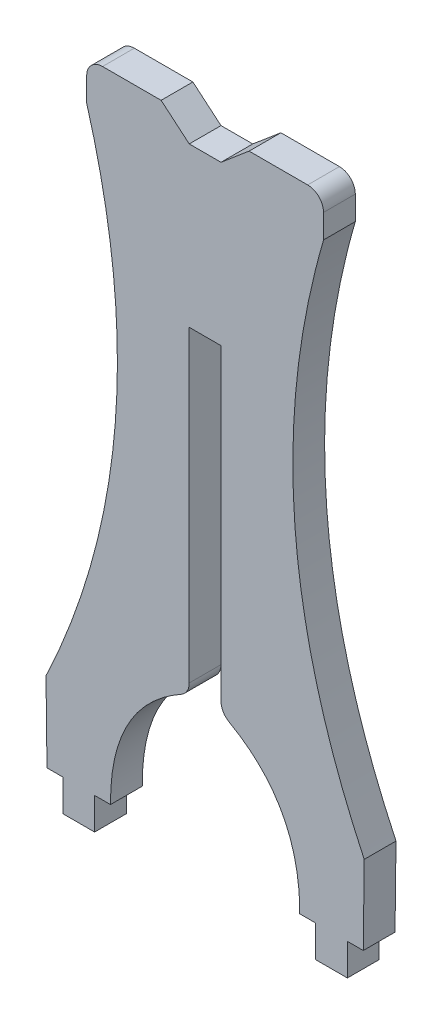
ISO-10303-21;
HEADER;
FILE_DESCRIPTION(('STEP AP214'),'2;1');
FILE_NAME('part.step','',(''),(''),'','','');
FILE_SCHEMA(('AUTOMOTIVE_DESIGN { 1 0 10303 214 1 1 1 1 }'));
ENDSEC;
DATA;
#1=APPLICATION_CONTEXT('core data for automotive mechanical design processes');
#2=APPLICATION_PROTOCOL_DEFINITION('international standard','automotive_design',2000,#1);
#3=PRODUCT_CONTEXT('',#1,'mechanical');
#4=PRODUCT('Part','Part','',(#3));
#5=PRODUCT_RELATED_PRODUCT_CATEGORY('part','',(#4));
#6=PRODUCT_DEFINITION_FORMATION('','',#4);
#7=PRODUCT_DEFINITION_CONTEXT('part definition',#1,'design');
#8=PRODUCT_DEFINITION('design','',#6,#7);
#9=PRODUCT_DEFINITION_SHAPE('','',#8);
#10=(LENGTH_UNIT() NAMED_UNIT(*) SI_UNIT(.MILLI.,.METRE.));
#11=(NAMED_UNIT(*) PLANE_ANGLE_UNIT() SI_UNIT($,.RADIAN.));
#12=(NAMED_UNIT(*) SI_UNIT($,.STERADIAN.) SOLID_ANGLE_UNIT());
#13=UNCERTAINTY_MEASURE_WITH_UNIT(LENGTH_MEASURE(1.E-05),#10,'distance_accuracy_value','');
#14=(GEOMETRIC_REPRESENTATION_CONTEXT(3) GLOBAL_UNCERTAINTY_ASSIGNED_CONTEXT((#13)) GLOBAL_UNIT_ASSIGNED_CONTEXT((#10,
#11,#12)) REPRESENTATION_CONTEXT('',''));
#15=CARTESIAN_POINT('',(0.,0.,0.));
#16=DIRECTION('',(0.,0.,1.));
#17=DIRECTION('',(1.,0.,0.));
#18=AXIS2_PLACEMENT_3D('',#15,#16,#17);
#19=CARTESIAN_POINT('',(27.9830745326083,55.8629681276195,5.08));
#20=DIRECTION('',(1.,0.,0.));
#21=DIRECTION('',(0.,1.,0.));
#22=AXIS2_PLACEMENT_3D('',#19,#20,#21);
#23=PLANE('',#22);
#24=DIRECTION('',(0.,-1.,0.));
#25=VECTOR('',#24,1.);
#26=CARTESIAN_POINT('',(27.9830745326083,55.8629681276195,0.));
#27=LINE('',#26,#25);
#28=CARTESIAN_POINT('',(27.9830745326083,55.8629681276195,0.));
#29=VERTEX_POINT('',#28);
#30=CARTESIAN_POINT('',(27.9830745326084,6.59401353380646,0.));
#31=VERTEX_POINT('',#30);
#32=EDGE_CURVE('E568',#29,#31,#27,.T.);
#33=ORIENTED_EDGE('',*,*,#32,.T.);
#34=DIRECTION('',(0.,0.,-1.));
#35=VECTOR('',#34,1.);
#36=CARTESIAN_POINT('',(27.9830745326084,6.59401353380646,5.08));
#37=LINE('',#36,#35);
#38=CARTESIAN_POINT('',(27.9830745326084,6.59401353380646,5.08));
#39=VERTEX_POINT('',#38);
#40=EDGE_CURVE('E348',#31,#39,#37,.F.);
#41=ORIENTED_EDGE('',*,*,#40,.T.);
#42=DIRECTION('',(0.,-1.,0.));
#43=VECTOR('',#42,1.);
#44=CARTESIAN_POINT('',(27.9830745326083,55.8629681276195,5.08));
#45=LINE('',#44,#43);
#46=CARTESIAN_POINT('',(27.9830745326083,55.8629681276195,5.08));
#47=VERTEX_POINT('',#46);
#48=EDGE_CURVE('E248',#47,#39,#45,.T.);
#49=ORIENTED_EDGE('',*,*,#48,.F.);
#50=DIRECTION('',(0.,0.,-1.));
#51=VECTOR('',#50,1.);
#52=CARTESIAN_POINT('',(27.9830745326083,55.8629681276195,5.08));
#53=LINE('',#52,#51);
#54=EDGE_CURVE('E470',#47,#29,#53,.T.);
#55=ORIENTED_EDGE('',*,*,#54,.T.);
#56=EDGE_LOOP('',(#33,#41,#49,#55));
#57=FACE_BOUND('',#56,.T.);
#58=ADVANCED_FACE('F39',(#57),#23,.F.);
#59=CARTESIAN_POINT('',(27.9830745326084,5.06296812761946,5.08));
#60=CARTESIAN_POINT('',(40.6838190643054,-1.22119794048092,5.08));
#61=CARTESIAN_POINT('',(40.5778042251728,-16.5430066938405,5.08));
#62=B_SPLINE_CURVE_WITH_KNOTS('',2,(#59,#60,#61),.UNSPECIFIED.,.F.,.F.,(3,3),(0.,1.),.UNSPECIFIED.);
#63=DIRECTION('',(0.,0.,-1.));
#64=VECTOR('',#63,1.);
#65=SURFACE_OF_LINEAR_EXTRUSION('',#62,#64);
#66=CARTESIAN_POINT('',(29.2790530108819,4.37951348786349,5.08));
#67=VERTEX_POINT('',#66);
#68=CARTESIAN_POINT('',(40.5778042251728,-16.5430066938405,5.08));
#69=VERTEX_POINT('',#68);
#70=EDGE_CURVE('E235',#67,#69,#62,.T.);
#71=ORIENTED_EDGE('',*,*,#70,.F.);
#72=DIRECTION('',(0.,0.,-1.));
#73=VECTOR('',#72,1.);
#74=CARTESIAN_POINT('',(29.2790530108819,4.37951348786349,5.08));
#75=LINE('',#74,#73);
#76=CARTESIAN_POINT('',(29.2790530108819,4.37951348786349,0.));
#77=VERTEX_POINT('',#76);
#78=EDGE_CURVE('E349',#67,#77,#75,.T.);
#79=ORIENTED_EDGE('',*,*,#78,.T.);
#80=CARTESIAN_POINT('',(27.9830745326084,5.06296812761946,0.));
#81=CARTESIAN_POINT('',(40.6838190643054,-1.22119794048092,0.));
#82=CARTESIAN_POINT('',(40.5778042251728,-16.5430066938405,0.));
#83=B_SPLINE_CURVE_WITH_KNOTS('',2,(#80,#81,#82),.UNSPECIFIED.,.F.,.F.,(3,3),(0.,1.),.UNSPECIFIED.);
#84=CARTESIAN_POINT('',(40.5778042251728,-16.5430066938405,0.));
#85=VERTEX_POINT('',#84);
#86=EDGE_CURVE('E254',#77,#85,#83,.T.);
#87=ORIENTED_EDGE('',*,*,#86,.T.);
#88=DIRECTION('',(0.,0.,-1.));
#89=VECTOR('',#88,1.);
#90=CARTESIAN_POINT('',(40.5778042251728,-16.5430066938405,5.08));
#91=LINE('',#90,#89);
#92=EDGE_CURVE('E251',#69,#85,#91,.T.);
#93=ORIENTED_EDGE('',*,*,#92,.F.);
#94=EDGE_LOOP('',(#71,#79,#87,#93));
#95=FACE_BOUND('',#94,.T.);
#96=ADVANCED_FACE('F252',(#95),#65,.F.);
#97=CARTESIAN_POINT('',(43.1178042251728,-16.5430066938405,5.08));
#98=DIRECTION('',(0.,1.,0.));
#99=DIRECTION('',(0.,0.,1.));
#100=AXIS2_PLACEMENT_3D('',#97,#98,#99);
#101=PLANE('',#100);
#102=DIRECTION('',(1.,0.,0.));
#103=VECTOR('',#102,1.);
#104=CARTESIAN_POINT('',(43.1178042251728,-16.5430066938405,0.));
#105=LINE('',#104,#103);
#106=CARTESIAN_POINT('',(43.1178042251728,-16.5430066938405,0.));
#107=VERTEX_POINT('',#106);
#108=EDGE_CURVE('E561',#85,#107,#105,.T.);
#109=ORIENTED_EDGE('',*,*,#108,.T.);
#110=DIRECTION('',(0.,0.,-1.));
#111=VECTOR('',#110,1.);
#112=CARTESIAN_POINT('',(43.1178042251728,-16.5430066938405,5.08));
#113=LINE('',#112,#111);
#114=CARTESIAN_POINT('',(43.1178042251728,-16.5430066938405,5.08));
#115=VERTEX_POINT('',#114);
#116=EDGE_CURVE('E259',#115,#107,#113,.T.);
#117=ORIENTED_EDGE('',*,*,#116,.F.);
#118=DIRECTION('',(1.,0.,0.));
#119=VECTOR('',#118,1.);
#120=CARTESIAN_POINT('',(43.1178042251728,-16.5430066938405,5.08));
#121=LINE('',#120,#119);
#122=EDGE_CURVE('E240',#69,#115,#121,.T.);
#123=ORIENTED_EDGE('',*,*,#122,.F.);
#124=ORIENTED_EDGE('',*,*,#92,.T.);
#125=EDGE_LOOP('',(#109,#117,#123,#124));
#126=FACE_BOUND('',#125,.T.);
#127=ADVANCED_FACE('F261',(#126),#101,.F.);
#128=CARTESIAN_POINT('',(43.1178042251728,-16.5430066938405,5.08));
#129=DIRECTION('',(1.,0.,0.));
#130=DIRECTION('',(0.,1.,0.));
#131=AXIS2_PLACEMENT_3D('',#128,#129,#130);
#132=PLANE('',#131);
#133=DIRECTION('',(0.,-1.,0.));
#134=VECTOR('',#133,1.);
#135=CARTESIAN_POINT('',(43.1178042251728,-16.5430066938405,0.));
#136=LINE('',#135,#134);
#137=CARTESIAN_POINT('',(43.1178042251728,-21.6230066938405,0.));
#138=VERTEX_POINT('',#137);
#139=EDGE_CURVE('E558',#107,#138,#136,.T.);
#140=ORIENTED_EDGE('',*,*,#139,.T.);
#141=DIRECTION('',(0.,0.,-1.));
#142=VECTOR('',#141,1.);
#143=CARTESIAN_POINT('',(43.1178042251728,-21.6230066938405,5.08));
#144=LINE('',#143,#142);
#145=CARTESIAN_POINT('',(43.1178042251728,-21.6230066938405,5.08));
#146=VERTEX_POINT('',#145);
#147=EDGE_CURVE('E394',#146,#138,#144,.T.);
#148=ORIENTED_EDGE('',*,*,#147,.F.);
#149=DIRECTION('',(0.,-1.,0.));
#150=VECTOR('',#149,1.);
#151=CARTESIAN_POINT('',(43.1178042251728,-16.5430066938405,5.08));
#152=LINE('',#151,#150);
#153=EDGE_CURVE('E265',#115,#146,#152,.T.);
#154=ORIENTED_EDGE('',*,*,#153,.F.);
#155=ORIENTED_EDGE('',*,*,#116,.T.);
#156=EDGE_LOOP('',(#140,#148,#154,#155));
#157=FACE_BOUND('',#156,.T.);
#158=ADVANCED_FACE('F320',(#157),#132,.F.);
#159=CARTESIAN_POINT('',(48.1978042251728,-21.6230066938405,5.08));
#160=DIRECTION('',(0.,1.,0.));
#161=DIRECTION('',(0.,0.,1.));
#162=AXIS2_PLACEMENT_3D('',#159,#160,#161);
#163=PLANE('',#162);
#164=DIRECTION('',(1.,0.,0.));
#165=VECTOR('',#164,1.);
#166=CARTESIAN_POINT('',(48.1978042251728,-21.6230066938405,0.));
#167=LINE('',#166,#165);
#168=CARTESIAN_POINT('',(48.1978042251728,-21.6230066938405,0.));
#169=VERTEX_POINT('',#168);
#170=EDGE_CURVE('E555',#138,#169,#167,.T.);
#171=ORIENTED_EDGE('',*,*,#170,.T.);
#172=DIRECTION('',(0.,0.,-1.));
#173=VECTOR('',#172,1.);
#174=CARTESIAN_POINT('',(48.1978042251728,-21.6230066938405,5.08));
#175=LINE('',#174,#173);
#176=CARTESIAN_POINT('',(48.1978042251728,-21.6230066938405,5.08));
#177=VERTEX_POINT('',#176);
#178=EDGE_CURVE('E398',#177,#169,#175,.T.);
#179=ORIENTED_EDGE('',*,*,#178,.F.);
#180=DIRECTION('',(1.,0.,0.));
#181=VECTOR('',#180,1.);
#182=CARTESIAN_POINT('',(48.1978042251728,-21.6230066938405,5.08));
#183=LINE('',#182,#181);
#184=EDGE_CURVE('E268',#146,#177,#183,.T.);
#185=ORIENTED_EDGE('',*,*,#184,.F.);
#186=ORIENTED_EDGE('',*,*,#147,.T.);
#187=EDGE_LOOP('',(#171,#179,#185,#186));
#188=FACE_BOUND('',#187,.T.);
#189=ADVANCED_FACE('F316',(#188),#163,.F.);
#190=CARTESIAN_POINT('',(48.1978042251728,-16.5430066938405,5.08));
#191=DIRECTION('',(-1.,0.,0.));
#192=DIRECTION('',(0.,-1.,0.));
#193=AXIS2_PLACEMENT_3D('',#190,#191,#192);
#194=PLANE('',#193);
#195=DIRECTION('',(0.,1.,0.));
#196=VECTOR('',#195,1.);
#197=CARTESIAN_POINT('',(48.1978042251728,-16.5430066938405,0.));
#198=LINE('',#197,#196);
#199=CARTESIAN_POINT('',(48.1978042251728,-16.5430066938405,0.));
#200=VERTEX_POINT('',#199);
#201=EDGE_CURVE('E552',#169,#200,#198,.T.);
#202=ORIENTED_EDGE('',*,*,#201,.T.);
#203=DIRECTION('',(0.,0.,-1.));
#204=VECTOR('',#203,1.);
#205=CARTESIAN_POINT('',(48.1978042251728,-16.5430066938405,5.08));
#206=LINE('',#205,#204);
#207=CARTESIAN_POINT('',(48.1978042251728,-16.5430066938405,5.08));
#208=VERTEX_POINT('',#207);
#209=EDGE_CURVE('E402',#208,#200,#206,.T.);
#210=ORIENTED_EDGE('',*,*,#209,.F.);
#211=DIRECTION('',(0.,1.,0.));
#212=VECTOR('',#211,1.);
#213=CARTESIAN_POINT('',(48.1978042251728,-16.5430066938405,5.08));
#214=LINE('',#213,#212);
#215=EDGE_CURVE('E277',#177,#208,#214,.T.);
#216=ORIENTED_EDGE('',*,*,#215,.F.);
#217=ORIENTED_EDGE('',*,*,#178,.T.);
#218=EDGE_LOOP('',(#202,#210,#216,#217));
#219=FACE_BOUND('',#218,.T.);
#220=ADVANCED_FACE('F312',(#219),#194,.F.);
#221=CARTESIAN_POINT('',(50.7378042251728,-16.5430066938405,5.08));
#222=DIRECTION('',(0.,1.,0.));
#223=DIRECTION('',(0.,0.,1.));
#224=AXIS2_PLACEMENT_3D('',#221,#222,#223);
#225=PLANE('',#224);
#226=DIRECTION('',(1.,0.,0.));
#227=VECTOR('',#226,1.);
#228=CARTESIAN_POINT('',(50.7378042251728,-16.5430066938405,0.));
#229=LINE('',#228,#227);
#230=CARTESIAN_POINT('',(50.7378042251728,-16.5430066938405,0.));
#231=VERTEX_POINT('',#230);
#232=EDGE_CURVE('E549',#200,#231,#229,.T.);
#233=ORIENTED_EDGE('',*,*,#232,.T.);
#234=DIRECTION('',(0.,0.,-1.));
#235=VECTOR('',#234,1.);
#236=CARTESIAN_POINT('',(50.7378042251728,-16.5430066938405,5.08));
#237=LINE('',#236,#235);
#238=CARTESIAN_POINT('',(50.7378042251728,-16.5430066938405,5.08));
#239=VERTEX_POINT('',#238);
#240=EDGE_CURVE('E406',#239,#231,#237,.T.);
#241=ORIENTED_EDGE('',*,*,#240,.F.);
#242=DIRECTION('',(1.,0.,0.));
#243=VECTOR('',#242,1.);
#244=CARTESIAN_POINT('',(50.7378042251728,-16.5430066938405,5.08));
#245=LINE('',#244,#243);
#246=EDGE_CURVE('E280',#208,#239,#245,.T.);
#247=ORIENTED_EDGE('',*,*,#246,.F.);
#248=ORIENTED_EDGE('',*,*,#209,.T.);
#249=EDGE_LOOP('',(#233,#241,#247,#248));
#250=FACE_BOUND('',#249,.T.);
#251=ADVANCED_FACE('F308',(#250),#225,.F.);
#252=CARTESIAN_POINT('',(50.7378042251728,-16.5430066938405,5.08));
#253=DIRECTION('',(-0.999926254512772,0.0121443623158392,0.));
#254=DIRECTION('',(-0.0121443623158392,-0.999926254512772,0.));
#255=AXIS2_PLACEMENT_3D('',#252,#253,#254);
#256=PLANE('',#255);
#257=DIRECTION('',(0.0121443623158392,0.999926254512772,0.));
#258=VECTOR('',#257,1.);
#259=CARTESIAN_POINT('',(50.7378042251728,-16.5430066938405,0.));
#260=LINE('',#259,#258);
#261=CARTESIAN_POINT('',(50.892037626584,-3.84394326152831,0.));
#262=VERTEX_POINT('',#261);
#263=EDGE_CURVE('E543',#231,#262,#260,.T.);
#264=ORIENTED_EDGE('',*,*,#263,.T.);
#265=DIRECTION('',(0.,0.,-1.));
#266=VECTOR('',#265,1.);
#267=CARTESIAN_POINT('',(50.892037626584,-3.84394326152831,5.08));
#268=LINE('',#267,#266);
#269=CARTESIAN_POINT('',(50.892037626584,-3.84394326152831,5.08));
#270=VERTEX_POINT('',#269);
#271=EDGE_CURVE('E410',#270,#262,#268,.T.);
#272=ORIENTED_EDGE('',*,*,#271,.F.);
#273=DIRECTION('',(0.0121443623158392,0.999926254512772,0.));
#274=VECTOR('',#273,1.);
#275=CARTESIAN_POINT('',(50.7378042251728,-16.5430066938405,5.08));
#276=LINE('',#275,#274);
#277=EDGE_CURVE('E283',#239,#270,#276,.T.);
#278=ORIENTED_EDGE('',*,*,#277,.F.);
#279=ORIENTED_EDGE('',*,*,#240,.T.);
#280=EDGE_LOOP('',(#264,#272,#278,#279));
#281=FACE_BOUND('',#280,.T.);
#282=ADVANCED_FACE('F303',(#281),#256,.F.);
#283=CARTESIAN_POINT('',(50.892037626584,-3.84394326152831,5.08));
#284=CARTESIAN_POINT('',(31.9843408580239,35.9899355292535,5.08));
#285=CARTESIAN_POINT('',(44.3859686406762,78.7069933061595,5.08));
#286=B_SPLINE_CURVE_WITH_KNOTS('',2,(#283,#284,#285),.UNSPECIFIED.,.F.,.F.,(3,3),(0.,1.),.UNSPECIFIED.);
#287=DIRECTION('',(0.,0.,-1.));
#288=VECTOR('',#287,1.);
#289=SURFACE_OF_LINEAR_EXTRUSION('',#286,#288);
#290=CARTESIAN_POINT('',(50.892037626584,-3.84394326152831,0.));
#291=CARTESIAN_POINT('',(31.9843408580239,35.9899355292535,0.));
#292=CARTESIAN_POINT('',(44.3859686406762,78.7069933061595,0.));
#293=B_SPLINE_CURVE_WITH_KNOTS('',2,(#290,#291,#292),.UNSPECIFIED.,.F.,.F.,(3,3),(0.,1.),.UNSPECIFIED.);
#294=CARTESIAN_POINT('',(44.3859686406762,78.7069933061595,0.));
#295=VERTEX_POINT('',#294);
#296=EDGE_CURVE('E538',#262,#295,#293,.T.);
#297=ORIENTED_EDGE('',*,*,#296,.T.);
#298=DIRECTION('',(0.,0.,-1.));
#299=VECTOR('',#298,1.);
#300=CARTESIAN_POINT('',(44.3859686406762,78.7069933061595,5.08));
#301=LINE('',#300,#299);
#302=CARTESIAN_POINT('',(44.3859686406762,78.7069933061595,5.08));
#303=VERTEX_POINT('',#302);
#304=EDGE_CURVE('E414',#303,#295,#301,.T.);
#305=ORIENTED_EDGE('',*,*,#304,.F.);
#306=EDGE_CURVE('E286',#270,#303,#286,.T.);
#307=ORIENTED_EDGE('',*,*,#306,.F.);
#308=ORIENTED_EDGE('',*,*,#271,.T.);
#309=EDGE_LOOP('',(#297,#305,#307,#308));
#310=FACE_BOUND('',#309,.T.);
#311=ADVANCED_FACE('F298',(#310),#289,.F.);
#312=CARTESIAN_POINT('',(44.3859686406762,85.0569933061595,5.08));
#313=DIRECTION('',(-1.,0.,0.));
#314=DIRECTION('',(0.,0.,1.));
#315=AXIS2_PLACEMENT_3D('',#312,#313,#314);
#316=PLANE('',#315);
#317=DIRECTION('',(0.,1.,0.));
#318=VECTOR('',#317,1.);
#319=CARTESIAN_POINT('',(44.3859686406762,85.0569933061595,0.));
#320=LINE('',#319,#318);
#321=CARTESIAN_POINT('',(44.3859686406762,82.5169933061595,0.));
#322=VERTEX_POINT('',#321);
#323=EDGE_CURVE('E534',#295,#322,#320,.T.);
#324=ORIENTED_EDGE('',*,*,#323,.T.);
#325=DIRECTION('',(0.,0.,-1.));
#326=VECTOR('',#325,1.);
#327=CARTESIAN_POINT('',(44.3859686406762,82.5169933061595,5.08));
#328=LINE('',#327,#326);
#329=CARTESIAN_POINT('',(44.3859686406762,82.5169933061595,5.08));
#330=VERTEX_POINT('',#329);
#331=EDGE_CURVE('E367',#322,#330,#328,.F.);
#332=ORIENTED_EDGE('',*,*,#331,.T.);
#333=DIRECTION('',(0.,1.,0.));
#334=VECTOR('',#333,1.);
#335=CARTESIAN_POINT('',(44.3859686406762,85.0569933061595,5.08));
#336=LINE('',#335,#334);
#337=EDGE_CURVE('E292',#303,#330,#336,.T.);
#338=ORIENTED_EDGE('',*,*,#337,.F.);
#339=ORIENTED_EDGE('',*,*,#304,.T.);
#340=EDGE_LOOP('',(#324,#332,#338,#339));
#341=FACE_BOUND('',#340,.T.);
#342=ADVANCED_FACE('F302',(#341),#316,.F.);
#343=CARTESIAN_POINT('',(44.3859686406762,85.0569933061595,5.08));
#344=DIRECTION('',(0.,-1.,0.));
#345=DIRECTION('',(0.,0.,-1.));
#346=AXIS2_PLACEMENT_3D('',#343,#344,#345);
#347=PLANE('',#346);
#348=DIRECTION('',(-1.,0.,0.));
#349=VECTOR('',#348,1.);
#350=CARTESIAN_POINT('',(44.3859686406762,85.0569933061595,5.08));
#351=LINE('',#350,#349);
#352=CARTESIAN_POINT('',(41.8459686406762,85.0569933061595,5.08));
#353=VERTEX_POINT('',#352);
#354=CARTESIAN_POINT('',(32.4797186406762,85.0569933061595,5.08));
#355=VERTEX_POINT('',#354);
#356=EDGE_CURVE('E911',#353,#355,#351,.T.);
#357=ORIENTED_EDGE('',*,*,#356,.F.);
#358=DIRECTION('',(0.,0.,-1.));
#359=VECTOR('',#358,1.);
#360=CARTESIAN_POINT('',(41.8459686406762,85.0569933061595,5.08));
#361=LINE('',#360,#359);
#362=CARTESIAN_POINT('',(41.8459686406762,85.0569933061595,0.));
#363=VERTEX_POINT('',#362);
#364=EDGE_CURVE('E370',#353,#363,#361,.T.);
#365=ORIENTED_EDGE('',*,*,#364,.T.);
#366=DIRECTION('',(-1.,0.,0.));
#367=VECTOR('',#366,1.);
#368=CARTESIAN_POINT('',(44.3859686406762,85.0569933061595,0.));
#369=LINE('',#368,#367);
#370=CARTESIAN_POINT('',(32.4797186406762,85.0569933061595,0.));
#371=VERTEX_POINT('',#370);
#372=EDGE_CURVE('E531',#363,#371,#369,.T.);
#373=ORIENTED_EDGE('',*,*,#372,.T.);
#374=DIRECTION('',(0.,0.,-1.));
#375=VECTOR('',#374,1.);
#376=CARTESIAN_POINT('',(32.4797186406762,85.0569933061595,5.08));
#377=LINE('',#376,#375);
#378=EDGE_CURVE('E418',#355,#371,#377,.T.);
#379=ORIENTED_EDGE('',*,*,#378,.F.);
#380=EDGE_LOOP('',(#357,#365,#373,#379));
#381=FACE_BOUND('',#380,.T.);
#382=ADVANCED_FACE('F746',(#381),#347,.F.);
#383=CARTESIAN_POINT('',(27.9830745326083,81.2629681276195,5.08));
#384=DIRECTION('',(0.644869123495258,-0.764293015513329,0.));
#385=DIRECTION('',(0.764293015513329,0.644869123495258,0.));
#386=AXIS2_PLACEMENT_3D('',#383,#384,#385);
#387=PLANE('',#386);
#388=DIRECTION('',(-0.764293015513329,-0.644869123495258,0.));
#389=VECTOR('',#388,1.);
#390=CARTESIAN_POINT('',(27.9830745326083,81.2629681276195,0.));
#391=LINE('',#390,#389);
#392=CARTESIAN_POINT('',(27.9830745326083,81.2629681276195,0.));
#393=VERTEX_POINT('',#392);
#394=EDGE_CURVE('E528',#371,#393,#391,.T.);
#395=ORIENTED_EDGE('',*,*,#394,.T.);
#396=DIRECTION('',(0.,0.,-1.));
#397=VECTOR('',#396,1.);
#398=CARTESIAN_POINT('',(27.9830745326083,81.2629681276195,5.08));
#399=LINE('',#398,#397);
#400=CARTESIAN_POINT('',(27.9830745326083,81.2629681276195,5.08));
#401=VERTEX_POINT('',#400);
#402=EDGE_CURVE('E422',#401,#393,#399,.T.);
#403=ORIENTED_EDGE('',*,*,#402,.F.);
#404=DIRECTION('',(-0.764293015513329,-0.644869123495258,0.));
#405=VECTOR('',#404,1.);
#406=CARTESIAN_POINT('',(27.9830745326083,81.2629681276195,5.08));
#407=LINE('',#406,#405);
#408=EDGE_CURVE('E909',#355,#401,#407,.T.);
#409=ORIENTED_EDGE('',*,*,#408,.F.);
#410=ORIENTED_EDGE('',*,*,#378,.T.);
#411=EDGE_LOOP('',(#395,#403,#409,#410));
#412=FACE_BOUND('',#411,.T.);
#413=ADVANCED_FACE('F756',(#412),#387,.F.);
#414=CARTESIAN_POINT('',(22.9030745326083,81.2629681276195,5.08));
#415=DIRECTION('',(0.,-1.,0.));
#416=DIRECTION('',(0.,0.,-1.));
#417=AXIS2_PLACEMENT_3D('',#414,#415,#416);
#418=PLANE('',#417);
#419=DIRECTION('',(-1.,0.,0.));
#420=VECTOR('',#419,1.);
#421=CARTESIAN_POINT('',(22.9030745326083,81.2629681276195,0.));
#422=LINE('',#421,#420);
#423=CARTESIAN_POINT('',(22.9030745326083,81.2629681276195,0.));
#424=VERTEX_POINT('',#423);
#425=EDGE_CURVE('E525',#393,#424,#422,.T.);
#426=ORIENTED_EDGE('',*,*,#425,.T.);
#427=DIRECTION('',(0.,0.,-1.));
#428=VECTOR('',#427,1.);
#429=CARTESIAN_POINT('',(22.9030745326083,81.2629681276195,5.08));
#430=LINE('',#429,#428);
#431=CARTESIAN_POINT('',(22.9030745326083,81.2629681276195,5.08));
#432=VERTEX_POINT('',#431);
#433=EDGE_CURVE('E426',#432,#424,#430,.T.);
#434=ORIENTED_EDGE('',*,*,#433,.F.);
#435=DIRECTION('',(-1.,0.,0.));
#436=VECTOR('',#435,1.);
#437=CARTESIAN_POINT('',(22.9030745326083,81.2629681276195,5.08));
#438=LINE('',#437,#436);
#439=EDGE_CURVE('E891',#401,#432,#438,.T.);
#440=ORIENTED_EDGE('',*,*,#439,.F.);
#441=ORIENTED_EDGE('',*,*,#402,.T.);
#442=EDGE_LOOP('',(#426,#434,#440,#441));
#443=FACE_BOUND('',#442,.T.);
#444=ADVANCED_FACE('F822',(#443),#418,.F.);
#445=CARTESIAN_POINT('',(22.9030745326083,81.2629681276195,5.08));
#446=DIRECTION('',(-0.644869123495257,-0.76429301551333,0.));
#447=DIRECTION('',(0.76429301551333,-0.644869123495257,0.));
#448=AXIS2_PLACEMENT_3D('',#445,#446,#447);
#449=PLANE('',#448);
#450=DIRECTION('',(-0.76429301551333,0.644869123495257,0.));
#451=VECTOR('',#450,1.);
#452=CARTESIAN_POINT('',(22.9030745326083,81.2629681276195,0.));
#453=LINE('',#452,#451);
#454=CARTESIAN_POINT('',(18.4064304245404,85.0569933061595,0.));
#455=VERTEX_POINT('',#454);
#456=EDGE_CURVE('E522',#424,#455,#453,.T.);
#457=ORIENTED_EDGE('',*,*,#456,.T.);
#458=DIRECTION('',(0.,0.,-1.));
#459=VECTOR('',#458,1.);
#460=CARTESIAN_POINT('',(18.4064304245404,85.0569933061595,5.08));
#461=LINE('',#460,#459);
#462=CARTESIAN_POINT('',(18.4064304245404,85.0569933061595,5.08));
#463=VERTEX_POINT('',#462);
#464=EDGE_CURVE('E430',#463,#455,#461,.T.);
#465=ORIENTED_EDGE('',*,*,#464,.F.);
#466=DIRECTION('',(-0.76429301551333,0.644869123495257,0.));
#467=VECTOR('',#466,1.);
#468=CARTESIAN_POINT('',(22.9030745326083,81.2629681276195,5.08));
#469=LINE('',#468,#467);
#470=EDGE_CURVE('E902',#432,#463,#469,.T.);
#471=ORIENTED_EDGE('',*,*,#470,.F.);
#472=ORIENTED_EDGE('',*,*,#433,.T.);
#473=EDGE_LOOP('',(#457,#465,#471,#472));
#474=FACE_BOUND('',#473,.T.);
#475=ADVANCED_FACE('F767',(#474),#449,.F.);
#476=CARTESIAN_POINT('',(6.50018042454045,85.0569933061595,5.08));
#477=DIRECTION('',(0.,-1.,0.));
#478=DIRECTION('',(0.,0.,-1.));
#479=AXIS2_PLACEMENT_3D('',#476,#477,#478);
#480=PLANE('',#479);
#481=DIRECTION('',(-1.,0.,0.));
#482=VECTOR('',#481,1.);
#483=CARTESIAN_POINT('',(6.50018042454045,85.0569933061595,0.));
#484=LINE('',#483,#482);
#485=CARTESIAN_POINT('',(9.04018042454045,85.0569933061595,0.));
#486=VERTEX_POINT('',#485);
#487=EDGE_CURVE('E518',#455,#486,#484,.T.);
#488=ORIENTED_EDGE('',*,*,#487,.T.);
#489=DIRECTION('',(0.,0.,-1.));
#490=VECTOR('',#489,1.);
#491=CARTESIAN_POINT('',(9.04018042454045,85.0569933061595,5.08));
#492=LINE('',#491,#490);
#493=CARTESIAN_POINT('',(9.04018042454045,85.0569933061595,5.08));
#494=VERTEX_POINT('',#493);
#495=EDGE_CURVE('E380',#486,#494,#492,.F.);
#496=ORIENTED_EDGE('',*,*,#495,.T.);
#497=DIRECTION('',(-1.,0.,0.));
#498=VECTOR('',#497,1.);
#499=CARTESIAN_POINT('',(6.50018042454045,85.0569933061595,5.08));
#500=LINE('',#499,#498);
#501=EDGE_CURVE('E899',#463,#494,#500,.T.);
#502=ORIENTED_EDGE('',*,*,#501,.F.);
#503=ORIENTED_EDGE('',*,*,#464,.T.);
#504=EDGE_LOOP('',(#488,#496,#502,#503));
#505=FACE_BOUND('',#504,.T.);
#506=ADVANCED_FACE('F763',(#505),#480,.F.);
#507=CARTESIAN_POINT('',(6.50018042454045,85.0569933061595,5.08));
#508=DIRECTION('',(1.,0.,0.));
#509=DIRECTION('',(0.,1.,0.));
#510=AXIS2_PLACEMENT_3D('',#507,#508,#509);
#511=PLANE('',#510);
#512=DIRECTION('',(0.,-1.,0.));
#513=VECTOR('',#512,1.);
#514=CARTESIAN_POINT('',(6.50018042454045,85.0569933061595,5.08));
#515=LINE('',#514,#513);
#516=CARTESIAN_POINT('',(6.50018042454045,82.5169933061595,5.08));
#517=VERTEX_POINT('',#516);
#518=CARTESIAN_POINT('',(6.50018042454045,78.7069933061595,5.08));
#519=VERTEX_POINT('',#518);
#520=EDGE_CURVE('E637',#517,#519,#515,.T.);
#521=ORIENTED_EDGE('',*,*,#520,.F.);
#522=DIRECTION('',(0.,0.,-1.));
#523=VECTOR('',#522,1.);
#524=CARTESIAN_POINT('',(6.50018042454045,82.5169933061595,5.08));
#525=LINE('',#524,#523);
#526=CARTESIAN_POINT('',(6.50018042454045,82.5169933061595,0.));
#527=VERTEX_POINT('',#526);
#528=EDGE_CURVE('E258',#517,#527,#525,.T.);
#529=ORIENTED_EDGE('',*,*,#528,.T.);
#530=DIRECTION('',(0.,-1.,0.));
#531=VECTOR('',#530,1.);
#532=CARTESIAN_POINT('',(6.50018042454045,85.0569933061595,0.));
#533=LINE('',#532,#531);
#534=CARTESIAN_POINT('',(6.50018042454045,78.7069933061595,0.));
#535=VERTEX_POINT('',#534);
#536=EDGE_CURVE('E512',#527,#535,#533,.T.);
#537=ORIENTED_EDGE('',*,*,#536,.T.);
#538=DIRECTION('',(0.,0.,-1.));
#539=VECTOR('',#538,1.);
#540=CARTESIAN_POINT('',(6.50018042454045,78.7069933061595,5.08));
#541=LINE('',#540,#539);
#542=EDGE_CURVE('E434',#519,#535,#541,.T.);
#543=ORIENTED_EDGE('',*,*,#542,.F.);
#544=EDGE_LOOP('',(#521,#529,#537,#543));
#545=FACE_BOUND('',#544,.T.);
#546=ADVANCED_FACE('F626',(#545),#511,.F.);
#547=CARTESIAN_POINT('',(6.50018042454045,78.7069933061595,5.08));
#548=CARTESIAN_POINT('',(18.9018082071928,35.9899355292535,5.08));
#549=CARTESIAN_POINT('',(-0.00588856136727721,-3.84394326152831,5.08));
#550=B_SPLINE_CURVE_WITH_KNOTS('',2,(#547,#548,#549),.UNSPECIFIED.,.F.,.F.,(3,3),(0.,1.),.UNSPECIFIED.);
#551=DIRECTION('',(0.,0.,-1.));
#552=VECTOR('',#551,1.);
#553=SURFACE_OF_LINEAR_EXTRUSION('',#550,#552);
#554=CARTESIAN_POINT('',(6.50018042454045,78.7069933061595,0.));
#555=CARTESIAN_POINT('',(18.9018082071928,35.9899355292535,0.));
#556=CARTESIAN_POINT('',(-0.00588856136727721,-3.84394326152831,0.));
#557=B_SPLINE_CURVE_WITH_KNOTS('',2,(#554,#555,#556),.UNSPECIFIED.,.F.,.F.,(3,3),(0.,1.),.UNSPECIFIED.);
#558=CARTESIAN_POINT('',(-0.00588856136727721,-3.84394326152831,0.));
#559=VERTEX_POINT('',#558);
#560=EDGE_CURVE('E507',#535,#559,#557,.T.);
#561=ORIENTED_EDGE('',*,*,#560,.T.);
#562=DIRECTION('',(0.,0.,-1.));
#563=VECTOR('',#562,1.);
#564=CARTESIAN_POINT('',(-0.00588856136727721,-3.84394326152831,5.08));
#565=LINE('',#564,#563);
#566=CARTESIAN_POINT('',(-0.00588856136727721,-3.84394326152831,5.08));
#567=VERTEX_POINT('',#566);
#568=EDGE_CURVE('E438',#567,#559,#565,.T.);
#569=ORIENTED_EDGE('',*,*,#568,.F.);
#570=EDGE_CURVE('E629',#519,#567,#550,.T.);
#571=ORIENTED_EDGE('',*,*,#570,.F.);
#572=ORIENTED_EDGE('',*,*,#542,.T.);
#573=EDGE_LOOP('',(#561,#569,#571,#572));
#574=FACE_BOUND('',#573,.T.);
#575=ADVANCED_FACE('F621',(#574),#553,.F.);
#576=CARTESIAN_POINT('',(0.148344840043882,-16.5430066938405,5.08));
#577=DIRECTION('',(0.999926254512772,0.0121443623158393,0.));
#578=DIRECTION('',(-0.0121443623158393,0.999926254512772,0.));
#579=AXIS2_PLACEMENT_3D('',#576,#577,#578);
#580=PLANE('',#579);
#581=DIRECTION('',(0.0121443623158393,-0.999926254512772,0.));
#582=VECTOR('',#581,1.);
#583=CARTESIAN_POINT('',(0.148344840043882,-16.5430066938405,0.));
#584=LINE('',#583,#582);
#585=CARTESIAN_POINT('',(0.148344840043882,-16.5430066938405,0.));
#586=VERTEX_POINT('',#585);
#587=EDGE_CURVE('E504',#559,#586,#584,.T.);
#588=ORIENTED_EDGE('',*,*,#587,.T.);
#589=DIRECTION('',(0.,0.,-1.));
#590=VECTOR('',#589,1.);
#591=CARTESIAN_POINT('',(0.148344840043882,-16.5430066938405,5.08));
#592=LINE('',#591,#590);
#593=CARTESIAN_POINT('',(0.148344840043882,-16.5430066938405,5.08));
#594=VERTEX_POINT('',#593);
#595=EDGE_CURVE('E442',#594,#586,#592,.T.);
#596=ORIENTED_EDGE('',*,*,#595,.F.);
#597=DIRECTION('',(0.0121443623158393,-0.999926254512772,0.));
#598=VECTOR('',#597,1.);
#599=CARTESIAN_POINT('',(0.148344840043882,-16.5430066938405,5.08));
#600=LINE('',#599,#598);
#601=EDGE_CURVE('E636',#567,#594,#600,.T.);
#602=ORIENTED_EDGE('',*,*,#601,.F.);
#603=ORIENTED_EDGE('',*,*,#568,.T.);
#604=EDGE_LOOP('',(#588,#596,#602,#603));
#605=FACE_BOUND('',#604,.T.);
#606=ADVANCED_FACE('F617',(#605),#580,.F.);
#607=CARTESIAN_POINT('',(0.148344840043882,-16.5430066938405,5.08));
#608=DIRECTION('',(0.,1.,0.));
#609=DIRECTION('',(0.,0.,1.));
#610=AXIS2_PLACEMENT_3D('',#607,#608,#609);
#611=PLANE('',#610);
#612=DIRECTION('',(1.,0.,0.));
#613=VECTOR('',#612,1.);
#614=CARTESIAN_POINT('',(0.148344840043882,-16.5430066938405,0.));
#615=LINE('',#614,#613);
#616=CARTESIAN_POINT('',(2.68834484004388,-16.5430066938405,0.));
#617=VERTEX_POINT('',#616);
#618=EDGE_CURVE('E501',#586,#617,#615,.T.);
#619=ORIENTED_EDGE('',*,*,#618,.T.);
#620=DIRECTION('',(0.,0.,-1.));
#621=VECTOR('',#620,1.);
#622=CARTESIAN_POINT('',(2.68834484004388,-16.5430066938405,5.08));
#623=LINE('',#622,#621);
#624=CARTESIAN_POINT('',(2.68834484004388,-16.5430066938405,5.08));
#625=VERTEX_POINT('',#624);
#626=EDGE_CURVE('E446',#625,#617,#623,.T.);
#627=ORIENTED_EDGE('',*,*,#626,.F.);
#628=DIRECTION('',(1.,0.,0.));
#629=VECTOR('',#628,1.);
#630=CARTESIAN_POINT('',(0.148344840043882,-16.5430066938405,5.08));
#631=LINE('',#630,#629);
#632=EDGE_CURVE('E644',#594,#625,#631,.T.);
#633=ORIENTED_EDGE('',*,*,#632,.F.);
#634=ORIENTED_EDGE('',*,*,#595,.T.);
#635=EDGE_LOOP('',(#619,#627,#633,#634));
#636=FACE_BOUND('',#635,.T.);
#637=ADVANCED_FACE('F613',(#636),#611,.F.);
#638=CARTESIAN_POINT('',(2.68834484004388,-16.5430066938405,5.08));
#639=DIRECTION('',(1.,0.,0.));
#640=DIRECTION('',(0.,1.,0.));
#641=AXIS2_PLACEMENT_3D('',#638,#639,#640);
#642=PLANE('',#641);
#643=DIRECTION('',(0.,-1.,0.));
#644=VECTOR('',#643,1.);
#645=CARTESIAN_POINT('',(2.68834484004388,-16.5430066938405,0.));
#646=LINE('',#645,#644);
#647=CARTESIAN_POINT('',(2.68834484004388,-21.6230066938405,0.));
#648=VERTEX_POINT('',#647);
#649=EDGE_CURVE('E498',#617,#648,#646,.T.);
#650=ORIENTED_EDGE('',*,*,#649,.T.);
#651=DIRECTION('',(0.,0.,-1.));
#652=VECTOR('',#651,1.);
#653=CARTESIAN_POINT('',(2.68834484004388,-21.6230066938405,5.08));
#654=LINE('',#653,#652);
#655=CARTESIAN_POINT('',(2.68834484004388,-21.6230066938405,5.08));
#656=VERTEX_POINT('',#655);
#657=EDGE_CURVE('E450',#656,#648,#654,.T.);
#658=ORIENTED_EDGE('',*,*,#657,.F.);
#659=DIRECTION('',(0.,-1.,0.));
#660=VECTOR('',#659,1.);
#661=CARTESIAN_POINT('',(2.68834484004388,-16.5430066938405,5.08));
#662=LINE('',#661,#660);
#663=EDGE_CURVE('E647',#625,#656,#662,.T.);
#664=ORIENTED_EDGE('',*,*,#663,.F.);
#665=ORIENTED_EDGE('',*,*,#626,.T.);
#666=EDGE_LOOP('',(#650,#658,#664,#665));
#667=FACE_BOUND('',#666,.T.);
#668=ADVANCED_FACE('F609',(#667),#642,.F.);
#669=CARTESIAN_POINT('',(2.68834484004388,-21.6230066938405,5.08));
#670=DIRECTION('',(0.,1.,0.));
#671=DIRECTION('',(0.,0.,1.));
#672=AXIS2_PLACEMENT_3D('',#669,#670,#671);
#673=PLANE('',#672);
#674=DIRECTION('',(1.,0.,0.));
#675=VECTOR('',#674,1.);
#676=CARTESIAN_POINT('',(2.68834484004388,-21.6230066938405,0.));
#677=LINE('',#676,#675);
#678=CARTESIAN_POINT('',(7.76834484004388,-21.6230066938405,0.));
#679=VERTEX_POINT('',#678);
#680=EDGE_CURVE('E495',#648,#679,#677,.T.);
#681=ORIENTED_EDGE('',*,*,#680,.T.);
#682=DIRECTION('',(0.,0.,-1.));
#683=VECTOR('',#682,1.);
#684=CARTESIAN_POINT('',(7.76834484004388,-21.6230066938405,5.08));
#685=LINE('',#684,#683);
#686=CARTESIAN_POINT('',(7.76834484004388,-21.6230066938405,5.08));
#687=VERTEX_POINT('',#686);
#688=EDGE_CURVE('E454',#687,#679,#685,.T.);
#689=ORIENTED_EDGE('',*,*,#688,.F.);
#690=DIRECTION('',(1.,0.,0.));
#691=VECTOR('',#690,1.);
#692=CARTESIAN_POINT('',(2.68834484004388,-21.6230066938405,5.08));
#693=LINE('',#692,#691);
#694=EDGE_CURVE('E650',#656,#687,#693,.T.);
#695=ORIENTED_EDGE('',*,*,#694,.F.);
#696=ORIENTED_EDGE('',*,*,#657,.T.);
#697=EDGE_LOOP('',(#681,#689,#695,#696));
#698=FACE_BOUND('',#697,.T.);
#699=ADVANCED_FACE('F605',(#698),#673,.F.);
#700=CARTESIAN_POINT('',(7.76834484004389,-16.5430066938405,5.08));
#701=DIRECTION('',(-1.,0.,0.));
#702=DIRECTION('',(0.,-1.,0.));
#703=AXIS2_PLACEMENT_3D('',#700,#701,#702);
#704=PLANE('',#703);
#705=DIRECTION('',(0.,1.,0.));
#706=VECTOR('',#705,1.);
#707=CARTESIAN_POINT('',(7.76834484004389,-16.5430066938405,0.));
#708=LINE('',#707,#706);
#709=CARTESIAN_POINT('',(7.76834484004389,-16.5430066938405,0.));
#710=VERTEX_POINT('',#709);
#711=EDGE_CURVE('E492',#679,#710,#708,.T.);
#712=ORIENTED_EDGE('',*,*,#711,.T.);
#713=DIRECTION('',(0.,0.,-1.));
#714=VECTOR('',#713,1.);
#715=CARTESIAN_POINT('',(7.76834484004389,-16.5430066938405,5.08));
#716=LINE('',#715,#714);
#717=CARTESIAN_POINT('',(7.76834484004389,-16.5430066938405,5.08));
#718=VERTEX_POINT('',#717);
#719=EDGE_CURVE('E458',#718,#710,#716,.T.);
#720=ORIENTED_EDGE('',*,*,#719,.F.);
#721=DIRECTION('',(0.,1.,0.));
#722=VECTOR('',#721,1.);
#723=CARTESIAN_POINT('',(7.76834484004389,-16.5430066938405,5.08));
#724=LINE('',#723,#722);
#725=EDGE_CURVE('E652',#687,#718,#724,.T.);
#726=ORIENTED_EDGE('',*,*,#725,.F.);
#727=ORIENTED_EDGE('',*,*,#688,.T.);
#728=EDGE_LOOP('',(#712,#720,#726,#727));
#729=FACE_BOUND('',#728,.T.);
#730=ADVANCED_FACE('F601',(#729),#704,.F.);
#731=CARTESIAN_POINT('',(7.76834484004389,-16.5430066938405,5.08));
#732=DIRECTION('',(0.,1.,0.));
#733=DIRECTION('',(0.,0.,1.));
#734=AXIS2_PLACEMENT_3D('',#731,#732,#733);
#735=PLANE('',#734);
#736=DIRECTION('',(1.,0.,0.));
#737=VECTOR('',#736,1.);
#738=CARTESIAN_POINT('',(7.76834484004389,-16.5430066938405,0.));
#739=LINE('',#738,#737);
#740=CARTESIAN_POINT('',(10.3083448400439,-16.5430066938405,0.));
#741=VERTEX_POINT('',#740);
#742=EDGE_CURVE('E486',#710,#741,#739,.T.);
#743=ORIENTED_EDGE('',*,*,#742,.T.);
#744=DIRECTION('',(0.,0.,-1.));
#745=VECTOR('',#744,1.);
#746=CARTESIAN_POINT('',(10.3083448400439,-16.5430066938405,5.08));
#747=LINE('',#746,#745);
#748=CARTESIAN_POINT('',(10.3083448400439,-16.5430066938405,5.08));
#749=VERTEX_POINT('',#748);
#750=EDGE_CURVE('E462',#749,#741,#747,.T.);
#751=ORIENTED_EDGE('',*,*,#750,.F.);
#752=DIRECTION('',(1.,0.,0.));
#753=VECTOR('',#752,1.);
#754=CARTESIAN_POINT('',(7.76834484004389,-16.5430066938405,5.08));
#755=LINE('',#754,#753);
#756=EDGE_CURVE('E586',#718,#749,#755,.T.);
#757=ORIENTED_EDGE('',*,*,#756,.F.);
#758=ORIENTED_EDGE('',*,*,#719,.T.);
#759=EDGE_LOOP('',(#743,#751,#757,#758));
#760=FACE_BOUND('',#759,.T.);
#761=ADVANCED_FACE('F597',(#760),#735,.F.);
#762=CARTESIAN_POINT('',(10.3083448400439,-16.5430066938405,5.08));
#763=CARTESIAN_POINT('',(10.2023300009113,-1.22119794048092,5.08));
#764=CARTESIAN_POINT('',(22.9030745326083,5.06296812761946,5.08));
#765=B_SPLINE_CURVE_WITH_KNOTS('',2,(#762,#763,#764),.UNSPECIFIED.,.F.,.F.,(3,3),(0.,1.),.UNSPECIFIED.);
#766=DIRECTION('',(0.,0.,-1.));
#767=VECTOR('',#766,1.);
#768=SURFACE_OF_LINEAR_EXTRUSION('',#765,#767);
#769=CARTESIAN_POINT('',(10.3083448400439,-16.5430066938405,0.));
#770=CARTESIAN_POINT('',(10.2023300009113,-1.22119794048092,0.));
#771=CARTESIAN_POINT('',(22.9030745326083,5.06296812761946,0.));
#772=B_SPLINE_CURVE_WITH_KNOTS('',2,(#769,#770,#771),.UNSPECIFIED.,.F.,.F.,(3,3),(0.,1.),.UNSPECIFIED.);
#773=CARTESIAN_POINT('',(21.6070960543348,4.37951348786349,0.));
#774=VERTEX_POINT('',#773);
#775=EDGE_CURVE('E481',#741,#774,#772,.T.);
#776=ORIENTED_EDGE('',*,*,#775,.T.);
#777=DIRECTION('',(0.,0.,-1.));
#778=VECTOR('',#777,1.);
#779=CARTESIAN_POINT('',(21.6070960543348,4.37951348786349,0.));
#780=LINE('',#779,#778);
#781=CARTESIAN_POINT('',(21.6070960543348,4.37951348786349,5.08));
#782=VERTEX_POINT('',#781);
#783=EDGE_CURVE('E11',#774,#782,#780,.F.);
#784=ORIENTED_EDGE('',*,*,#783,.T.);
#785=EDGE_CURVE('E580',#749,#782,#765,.T.);
#786=ORIENTED_EDGE('',*,*,#785,.F.);
#787=ORIENTED_EDGE('',*,*,#750,.T.);
#788=EDGE_LOOP('',(#776,#784,#786,#787));
#789=FACE_BOUND('',#788,.T.);
#790=ADVANCED_FACE('F592',(#789),#768,.F.);
#791=CARTESIAN_POINT('',(22.9030745326083,55.8629681276195,5.08));
#792=DIRECTION('',(-1.,0.,0.));
#793=DIRECTION('',(0.,-1.,0.));
#794=AXIS2_PLACEMENT_3D('',#791,#792,#793);
#795=PLANE('',#794);
#796=DIRECTION('',(0.,1.,0.));
#797=VECTOR('',#796,1.);
#798=CARTESIAN_POINT('',(22.9030745326083,55.8629681276195,5.08));
#799=LINE('',#798,#797);
#800=CARTESIAN_POINT('',(22.9030745326083,6.59401353380646,5.08));
#801=VERTEX_POINT('',#800);
#802=CARTESIAN_POINT('',(22.9030745326083,55.8629681276195,5.08));
#803=VERTEX_POINT('',#802);
#804=EDGE_CURVE('E577',#801,#803,#799,.T.);
#805=ORIENTED_EDGE('',*,*,#804,.F.);
#806=DIRECTION('',(0.,0.,-1.));
#807=VECTOR('',#806,1.);
#808=CARTESIAN_POINT('',(22.9030745326083,6.59401353380646,5.08));
#809=LINE('',#808,#807);
#810=CARTESIAN_POINT('',(22.9030745326083,6.59401353380646,0.));
#811=VERTEX_POINT('',#810);
#812=EDGE_CURVE('E48',#801,#811,#809,.T.);
#813=ORIENTED_EDGE('',*,*,#812,.T.);
#814=DIRECTION('',(0.,1.,0.));
#815=VECTOR('',#814,1.);
#816=CARTESIAN_POINT('',(22.9030745326083,55.8629681276195,0.));
#817=LINE('',#816,#815);
#818=CARTESIAN_POINT('',(22.9030745326083,55.8629681276195,0.));
#819=VERTEX_POINT('',#818);
#820=EDGE_CURVE('E478',#811,#819,#817,.T.);
#821=ORIENTED_EDGE('',*,*,#820,.T.);
#822=DIRECTION('',(0.,0.,-1.));
#823=VECTOR('',#822,1.);
#824=CARTESIAN_POINT('',(22.9030745326083,55.8629681276195,5.08));
#825=LINE('',#824,#823);
#826=EDGE_CURVE('E466',#803,#819,#825,.T.);
#827=ORIENTED_EDGE('',*,*,#826,.F.);
#828=EDGE_LOOP('',(#805,#813,#821,#827));
#829=FACE_BOUND('',#828,.T.);
#830=ADVANCED_FACE('F596',(#829),#795,.F.);
#831=CARTESIAN_POINT('',(27.9830745326083,55.8629681276195,5.08));
#832=DIRECTION('',(0.,1.,0.));
#833=DIRECTION('',(0.,0.,1.));
#834=AXIS2_PLACEMENT_3D('',#831,#832,#833);
#835=PLANE('',#834);
#836=DIRECTION('',(1.,0.,0.));
#837=VECTOR('',#836,1.);
#838=CARTESIAN_POINT('',(27.9830745326083,55.8629681276195,0.));
#839=LINE('',#838,#837);
#840=EDGE_CURVE('E475',#819,#29,#839,.T.);
#841=ORIENTED_EDGE('',*,*,#840,.T.);
#842=ORIENTED_EDGE('',*,*,#54,.F.);
#843=DIRECTION('',(1.,0.,0.));
#844=VECTOR('',#843,1.);
#845=CARTESIAN_POINT('',(27.9830745326083,55.8629681276195,5.08));
#846=LINE('',#845,#844);
#847=EDGE_CURVE('E474',#803,#47,#846,.T.);
#848=ORIENTED_EDGE('',*,*,#847,.F.);
#849=ORIENTED_EDGE('',*,*,#826,.T.);
#850=EDGE_LOOP('',(#841,#842,#848,#849));
#851=FACE_BOUND('',#850,.T.);
#852=ADVANCED_FACE('F670',(#851),#835,.F.);
#853=CARTESIAN_POINT('',(37.482129221598,-3.48060861179572,5.08));
#854=DIRECTION('',(0.,0.,1.));
#855=DIRECTION('',(1.,0.,0.));
#856=AXIS2_PLACEMENT_3D('',#853,#854,#855);
#857=PLANE('',#856);
#858=ORIENTED_EDGE('',*,*,#48,.T.);
#859=CARTESIAN_POINT('',(30.5230745326084,6.59401353380646,5.08));
#860=DIRECTION('',(0.,0.,1.));
#861=DIRECTION('',(1.,0.,0.));
#862=AXIS2_PLACEMENT_3D('',#859,#860,#861);
#863=CIRCLE('',#862,2.54);
#864=EDGE_CURVE('E243',#39,#67,#863,.T.);
#865=ORIENTED_EDGE('',*,*,#864,.T.);
#866=ORIENTED_EDGE('',*,*,#70,.T.);
#867=ORIENTED_EDGE('',*,*,#122,.T.);
#868=ORIENTED_EDGE('',*,*,#153,.T.);
#869=ORIENTED_EDGE('',*,*,#184,.T.);
#870=ORIENTED_EDGE('',*,*,#215,.T.);
#871=ORIENTED_EDGE('',*,*,#246,.T.);
#872=ORIENTED_EDGE('',*,*,#277,.T.);
#873=ORIENTED_EDGE('',*,*,#306,.T.);
#874=ORIENTED_EDGE('',*,*,#337,.T.);
#875=CARTESIAN_POINT('',(41.8459686406762,82.5169933061595,5.08));
#876=DIRECTION('',(0.,0.,1.));
#877=DIRECTION('',(1.,0.,0.));
#878=AXIS2_PLACEMENT_3D('',#875,#876,#877);
#879=CIRCLE('',#878,2.54);
#880=EDGE_CURVE('E377',#330,#353,#879,.T.);
#881=ORIENTED_EDGE('',*,*,#880,.T.);
#882=ORIENTED_EDGE('',*,*,#356,.T.);
#883=ORIENTED_EDGE('',*,*,#408,.T.);
#884=ORIENTED_EDGE('',*,*,#439,.T.);
#885=ORIENTED_EDGE('',*,*,#470,.T.);
#886=ORIENTED_EDGE('',*,*,#501,.T.);
#887=CARTESIAN_POINT('',(9.04018042454045,82.5169933061595,5.08));
#888=DIRECTION('',(0.,0.,1.));
#889=DIRECTION('',(1.,0.,0.));
#890=AXIS2_PLACEMENT_3D('',#887,#888,#889);
#891=CIRCLE('',#890,2.54);
#892=EDGE_CURVE('E374',#494,#517,#891,.T.);
#893=ORIENTED_EDGE('',*,*,#892,.T.);
#894=ORIENTED_EDGE('',*,*,#520,.T.);
#895=ORIENTED_EDGE('',*,*,#570,.T.);
#896=ORIENTED_EDGE('',*,*,#601,.T.);
#897=ORIENTED_EDGE('',*,*,#632,.T.);
#898=ORIENTED_EDGE('',*,*,#663,.T.);
#899=ORIENTED_EDGE('',*,*,#694,.T.);
#900=ORIENTED_EDGE('',*,*,#725,.T.);
#901=ORIENTED_EDGE('',*,*,#756,.T.);
#902=ORIENTED_EDGE('',*,*,#785,.T.);
#903=CARTESIAN_POINT('',(20.3630745326084,6.59401353380646,5.08));
#904=DIRECTION('',(0.,0.,1.));
#905=DIRECTION('',(1.,0.,0.));
#906=AXIS2_PLACEMENT_3D('',#903,#904,#905);
#907=CIRCLE('',#906,2.54);
#908=EDGE_CURVE('E55',#782,#801,#907,.T.);
#909=ORIENTED_EDGE('',*,*,#908,.T.);
#910=ORIENTED_EDGE('',*,*,#804,.T.);
#911=ORIENTED_EDGE('',*,*,#847,.T.);
#912=EDGE_LOOP('',(#858,#865,#866,#867,#868,#869,#870,#871,#872,#873,#874,#881,#882,#883,#884,
#885,#886,#893,#894,#895,#896,#897,#898,#899,#900,#901,#902,#909,#910,#911));
#913=FACE_BOUND('',#912,.T.);
#914=ADVANCED_FACE('F238',(#913),#857,.T.);
#915=CARTESIAN_POINT('',(37.482129221598,-3.48060861179572,0.));
#916=DIRECTION('',(0.,0.,1.));
#917=DIRECTION('',(1.,0.,0.));
#918=AXIS2_PLACEMENT_3D('',#915,#916,#917);
#919=PLANE('',#918);
#920=ORIENTED_EDGE('',*,*,#86,.F.);
#921=CARTESIAN_POINT('',(30.5230745326084,6.59401353380646,0.));
#922=DIRECTION('',(0.,0.,1.));
#923=DIRECTION('',(1.,0.,0.));
#924=AXIS2_PLACEMENT_3D('',#921,#922,#923);
#925=CIRCLE('',#924,2.54);
#926=EDGE_CURVE('E359',#77,#31,#925,.F.);
#927=ORIENTED_EDGE('',*,*,#926,.T.);
#928=ORIENTED_EDGE('',*,*,#32,.F.);
#929=ORIENTED_EDGE('',*,*,#840,.F.);
#930=ORIENTED_EDGE('',*,*,#820,.F.);
#931=CARTESIAN_POINT('',(20.3630745326084,6.59401353380646,0.));
#932=DIRECTION('',(0.,0.,1.));
#933=DIRECTION('',(1.,0.,0.));
#934=AXIS2_PLACEMENT_3D('',#931,#932,#933);
#935=CIRCLE('',#934,2.54);
#936=EDGE_CURVE('E362',#811,#774,#935,.F.);
#937=ORIENTED_EDGE('',*,*,#936,.T.);
#938=ORIENTED_EDGE('',*,*,#775,.F.);
#939=ORIENTED_EDGE('',*,*,#742,.F.);
#940=ORIENTED_EDGE('',*,*,#711,.F.);
#941=ORIENTED_EDGE('',*,*,#680,.F.);
#942=ORIENTED_EDGE('',*,*,#649,.F.);
#943=ORIENTED_EDGE('',*,*,#618,.F.);
#944=ORIENTED_EDGE('',*,*,#587,.F.);
#945=ORIENTED_EDGE('',*,*,#560,.F.);
#946=ORIENTED_EDGE('',*,*,#536,.F.);
#947=CARTESIAN_POINT('',(9.04018042454045,82.5169933061595,0.));
#948=DIRECTION('',(0.,0.,1.));
#949=DIRECTION('',(1.,0.,0.));
#950=AXIS2_PLACEMENT_3D('',#947,#948,#949);
#951=CIRCLE('',#950,2.54);
#952=EDGE_CURVE('E383',#527,#486,#951,.F.);
#953=ORIENTED_EDGE('',*,*,#952,.T.);
#954=ORIENTED_EDGE('',*,*,#487,.F.);
#955=ORIENTED_EDGE('',*,*,#456,.F.);
#956=ORIENTED_EDGE('',*,*,#425,.F.);
#957=ORIENTED_EDGE('',*,*,#394,.F.);
#958=ORIENTED_EDGE('',*,*,#372,.F.);
#959=CARTESIAN_POINT('',(41.8459686406762,82.5169933061595,0.));
#960=DIRECTION('',(0.,0.,1.));
#961=DIRECTION('',(1.,0.,0.));
#962=AXIS2_PLACEMENT_3D('',#959,#960,#961);
#963=CIRCLE('',#962,2.54);
#964=EDGE_CURVE('E386',#363,#322,#963,.F.);
#965=ORIENTED_EDGE('',*,*,#964,.T.);
#966=ORIENTED_EDGE('',*,*,#323,.F.);
#967=ORIENTED_EDGE('',*,*,#296,.F.);
#968=ORIENTED_EDGE('',*,*,#263,.F.);
#969=ORIENTED_EDGE('',*,*,#232,.F.);
#970=ORIENTED_EDGE('',*,*,#201,.F.);
#971=ORIENTED_EDGE('',*,*,#170,.F.);
#972=ORIENTED_EDGE('',*,*,#139,.F.);
#973=ORIENTED_EDGE('',*,*,#108,.F.);
#974=EDGE_LOOP('',(#920,#927,#928,#929,#930,#937,#938,#939,#940,#941,#942,#943,#944,#945,#946,
#953,#954,#955,#956,#957,#958,#965,#966,#967,#968,#969,#970,#971,#972,#973));
#975=FACE_BOUND('',#974,.T.);
#976=ADVANCED_FACE('F336',(#975),#919,.F.);
#977=CARTESIAN_POINT('',(9.04018042454045,82.5169933061595,5.08));
#978=DIRECTION('',(0.,0.,-1.));
#979=DIRECTION('',(-1.,0.,0.));
#980=AXIS2_PLACEMENT_3D('',#977,#978,#979);
#981=CYLINDRICAL_SURFACE('',#980,2.54);
#982=ORIENTED_EDGE('',*,*,#892,.F.);
#983=ORIENTED_EDGE('',*,*,#495,.F.);
#984=ORIENTED_EDGE('',*,*,#952,.F.);
#985=ORIENTED_EDGE('',*,*,#528,.F.);
#986=EDGE_LOOP('',(#982,#983,#984,#985));
#987=FACE_BOUND('',#986,.T.);
#988=ADVANCED_FACE('F332',(#987),#981,.T.);
#989=CARTESIAN_POINT('',(41.8459686406762,82.5169933061595,5.08));
#990=DIRECTION('',(0.,0.,-1.));
#991=DIRECTION('',(-1.,0.,0.));
#992=AXIS2_PLACEMENT_3D('',#989,#990,#991);
#993=CYLINDRICAL_SURFACE('',#992,2.54);
#994=ORIENTED_EDGE('',*,*,#880,.F.);
#995=ORIENTED_EDGE('',*,*,#331,.F.);
#996=ORIENTED_EDGE('',*,*,#964,.F.);
#997=ORIENTED_EDGE('',*,*,#364,.F.);
#998=EDGE_LOOP('',(#994,#995,#996,#997));
#999=FACE_BOUND('',#998,.T.);
#1000=ADVANCED_FACE('F335',(#999),#993,.T.);
#1001=CARTESIAN_POINT('',(30.5230745326084,6.59401353380646,2.54));
#1002=DIRECTION('',(0.,0.,-1.));
#1003=DIRECTION('',(-1.,0.,0.));
#1004=AXIS2_PLACEMENT_3D('',#1001,#1002,#1003);
#1005=CYLINDRICAL_SURFACE('',#1004,2.54);
#1006=ORIENTED_EDGE('',*,*,#864,.F.);
#1007=ORIENTED_EDGE('',*,*,#40,.F.);
#1008=ORIENTED_EDGE('',*,*,#926,.F.);
#1009=ORIENTED_EDGE('',*,*,#78,.F.);
#1010=EDGE_LOOP('',(#1006,#1007,#1008,#1009));
#1011=FACE_BOUND('',#1010,.T.);
#1012=ADVANCED_FACE('F339',(#1011),#1005,.T.);
#1013=CARTESIAN_POINT('',(20.3630745326084,6.59401353380646,2.54));
#1014=DIRECTION('',(0.,0.,-1.));
#1015=DIRECTION('',(-1.,0.,0.));
#1016=AXIS2_PLACEMENT_3D('',#1013,#1014,#1015);
#1017=CYLINDRICAL_SURFACE('',#1016,2.54);
#1018=ORIENTED_EDGE('',*,*,#908,.F.);
#1019=ORIENTED_EDGE('',*,*,#783,.F.);
#1020=ORIENTED_EDGE('',*,*,#936,.F.);
#1021=ORIENTED_EDGE('',*,*,#812,.F.);
#1022=EDGE_LOOP('',(#1018,#1019,#1020,#1021));
#1023=FACE_BOUND('',#1022,.T.);
#1024=ADVANCED_FACE('F41',(#1023),#1017,.T.);
#1025=CLOSED_SHELL('',(#58,#96,#127,#158,#189,#220,#251,#282,#311,#342,#382,#413,#444,#475,#506,
#546,#575,#606,#637,#668,#699,#730,#761,#790,#830,#852,#914,#976,#988,#1000,#1012,#1024));
#1026=MANIFOLD_SOLID_BREP('B2',#1025);
#1027=ADVANCED_BREP_SHAPE_REPRESENTATION('',(#18,#1026),#14);
#1028=SHAPE_DEFINITION_REPRESENTATION(#9,#1027);
ENDSEC;
END-ISO-10303-21;
